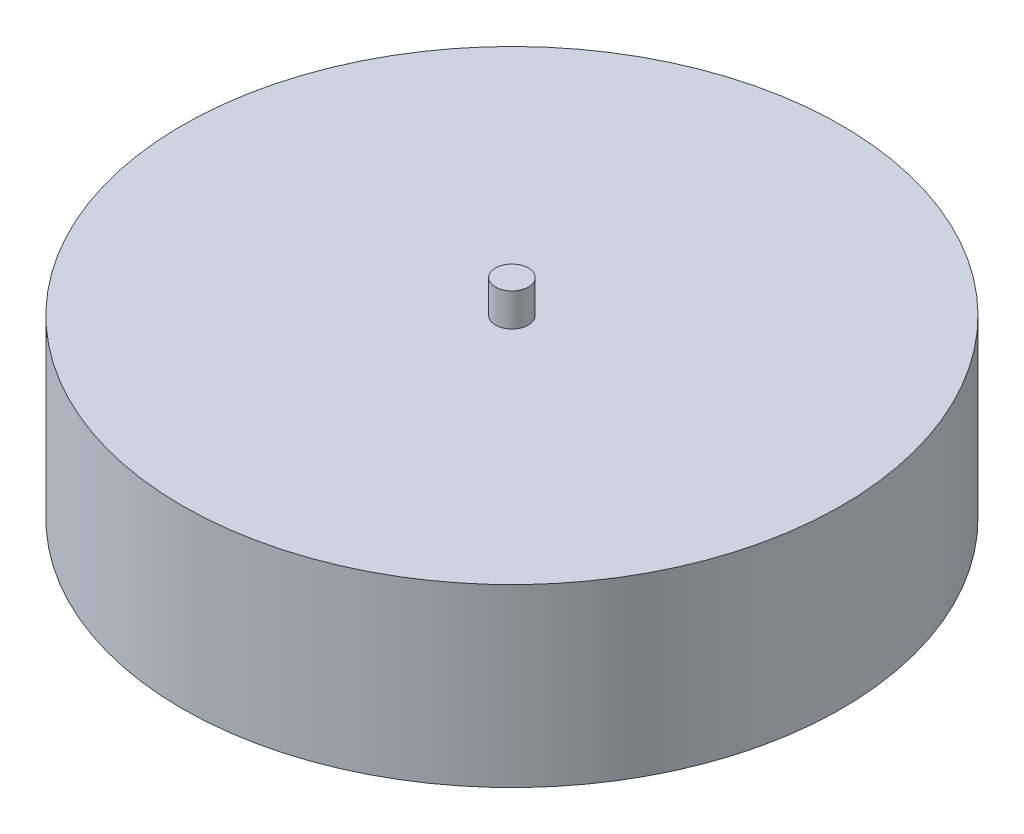
ISO-10303-21;
HEADER;
FILE_DESCRIPTION(('STEP AP214'),'2;1');
FILE_NAME('part.step','',(''),(''),'','','');
FILE_SCHEMA(('AUTOMOTIVE_DESIGN { 1 0 10303 214 1 1 1 1 }'));
ENDSEC;
DATA;
#1=APPLICATION_CONTEXT('core data for automotive mechanical design processes');
#2=APPLICATION_PROTOCOL_DEFINITION('international standard','automotive_design',2000,#1);
#3=PRODUCT_CONTEXT('',#1,'mechanical');
#4=PRODUCT('Part','Part','',(#3));
#5=PRODUCT_RELATED_PRODUCT_CATEGORY('part','',(#4));
#6=PRODUCT_DEFINITION_FORMATION('','',#4);
#7=PRODUCT_DEFINITION_CONTEXT('part definition',#1,'design');
#8=PRODUCT_DEFINITION('design','',#6,#7);
#9=PRODUCT_DEFINITION_SHAPE('','',#8);
#10=(LENGTH_UNIT() NAMED_UNIT(*) SI_UNIT(.MILLI.,.METRE.));
#11=(NAMED_UNIT(*) PLANE_ANGLE_UNIT() SI_UNIT($,.RADIAN.));
#12=(NAMED_UNIT(*) SI_UNIT($,.STERADIAN.) SOLID_ANGLE_UNIT());
#13=UNCERTAINTY_MEASURE_WITH_UNIT(LENGTH_MEASURE(1.E-05),#10,'distance_accuracy_value','');
#14=(GEOMETRIC_REPRESENTATION_CONTEXT(3) GLOBAL_UNCERTAINTY_ASSIGNED_CONTEXT((#13)) GLOBAL_UNIT_ASSIGNED_CONTEXT((#10,
#11,#12)) REPRESENTATION_CONTEXT('',''));
#15=CARTESIAN_POINT('',(0.,0.,0.));
#16=DIRECTION('',(0.,0.,1.));
#17=DIRECTION('',(1.,0.,0.));
#18=AXIS2_PLACEMENT_3D('',#15,#16,#17);
#19=CARTESIAN_POINT('',(0.,32.,0.));
#20=DIRECTION('',(0.,-1.,0.));
#21=DIRECTION('',(0.,0.,-1.));
#22=AXIS2_PLACEMENT_3D('',#19,#20,#21);
#23=CYLINDRICAL_SURFACE('',#22,60.);
#24=CARTESIAN_POINT('',(0.,32.,0.));
#25=DIRECTION('',(0.,1.,0.));
#26=DIRECTION('',(0.,0.,1.));
#27=AXIS2_PLACEMENT_3D('',#24,#25,#26);
#28=CIRCLE('',#27,60.);
#29=CARTESIAN_POINT('',(0.,32.,60.));
#30=VERTEX_POINT('',#29);
#31=EDGE_CURVE('E10',#30,#30,#28,.T.);
#32=ORIENTED_EDGE('',*,*,#31,.F.);
#33=EDGE_LOOP('',(#32));
#34=FACE_BOUND('',#33,.T.);
#35=CARTESIAN_POINT('',(0.,0.,0.));
#36=DIRECTION('',(0.,1.,0.));
#37=DIRECTION('',(0.,0.,1.));
#38=AXIS2_PLACEMENT_3D('',#35,#36,#37);
#39=CIRCLE('',#38,60.);
#40=CARTESIAN_POINT('',(0.,0.,60.));
#41=VERTEX_POINT('',#40);
#42=EDGE_CURVE('E34',#41,#41,#39,.T.);
#43=ORIENTED_EDGE('',*,*,#42,.T.);
#44=EDGE_LOOP('',(#43));
#45=FACE_BOUND('',#44,.T.);
#46=ADVANCED_FACE('F31',(#34,#45),#23,.T.);
#47=CARTESIAN_POINT('',(0.,32.,0.));
#48=DIRECTION('',(0.,1.,0.));
#49=DIRECTION('',(0.,0.,1.));
#50=AXIS2_PLACEMENT_3D('',#47,#48,#49);
#51=PLANE('',#50);
#52=CARTESIAN_POINT('',(0.,32.,0.));
#53=DIRECTION('',(0.,1.,0.));
#54=DIRECTION('',(0.,0.,1.));
#55=AXIS2_PLACEMENT_3D('',#52,#53,#54);
#56=CIRCLE('',#55,3.);
#57=CARTESIAN_POINT('',(0.,32.,3.));
#58=VERTEX_POINT('',#57);
#59=EDGE_CURVE('E43',#58,#58,#56,.T.);
#60=ORIENTED_EDGE('',*,*,#59,.F.);
#61=EDGE_LOOP('',(#60));
#62=FACE_BOUND('',#61,.T.);
#63=ORIENTED_EDGE('',*,*,#31,.T.);
#64=EDGE_LOOP('',(#63));
#65=FACE_BOUND('',#64,.T.);
#66=ADVANCED_FACE('F58',(#62,#65),#51,.T.);
#67=CARTESIAN_POINT('',(0.,0.,0.));
#68=DIRECTION('',(0.,1.,0.));
#69=DIRECTION('',(0.,0.,1.));
#70=AXIS2_PLACEMENT_3D('',#67,#68,#69);
#71=PLANE('',#70);
#72=ORIENTED_EDGE('',*,*,#42,.F.);
#73=EDGE_LOOP('',(#72));
#74=FACE_BOUND('',#73,.T.);
#75=ADVANCED_FACE('F54',(#74),#71,.F.);
#76=CARTESIAN_POINT('',(0.,38.,0.));
#77=DIRECTION('',(0.,-1.,0.));
#78=DIRECTION('',(0.,0.,-1.));
#79=AXIS2_PLACEMENT_3D('',#76,#77,#78);
#80=CYLINDRICAL_SURFACE('',#79,3.);
#81=CARTESIAN_POINT('',(0.,38.,0.));
#82=DIRECTION('',(0.,1.,0.));
#83=DIRECTION('',(0.,0.,1.));
#84=AXIS2_PLACEMENT_3D('',#81,#82,#83);
#85=CIRCLE('',#84,3.);
#86=CARTESIAN_POINT('',(0.,38.,3.));
#87=VERTEX_POINT('',#86);
#88=EDGE_CURVE('E41',#87,#87,#85,.T.);
#89=ORIENTED_EDGE('',*,*,#88,.F.);
#90=EDGE_LOOP('',(#89));
#91=FACE_BOUND('',#90,.T.);
#92=ORIENTED_EDGE('',*,*,#59,.T.);
#93=EDGE_LOOP('',(#92));
#94=FACE_BOUND('',#93,.T.);
#95=ADVANCED_FACE('F51',(#91,#94),#80,.T.);
#96=CARTESIAN_POINT('',(0.,38.,0.));
#97=DIRECTION('',(0.,1.,0.));
#98=DIRECTION('',(0.,0.,1.));
#99=AXIS2_PLACEMENT_3D('',#96,#97,#98);
#100=PLANE('',#99);
#101=ORIENTED_EDGE('',*,*,#88,.T.);
#102=EDGE_LOOP('',(#101));
#103=FACE_BOUND('',#102,.T.);
#104=ADVANCED_FACE('F49',(#103),#100,.T.);
#105=CLOSED_SHELL('',(#46,#66,#75,#95,#104));
#106=MANIFOLD_SOLID_BREP('B2',#105);
#107=ADVANCED_BREP_SHAPE_REPRESENTATION('',(#18,#106),#14);
#108=SHAPE_DEFINITION_REPRESENTATION(#9,#107);
ENDSEC;
END-ISO-10303-21;
